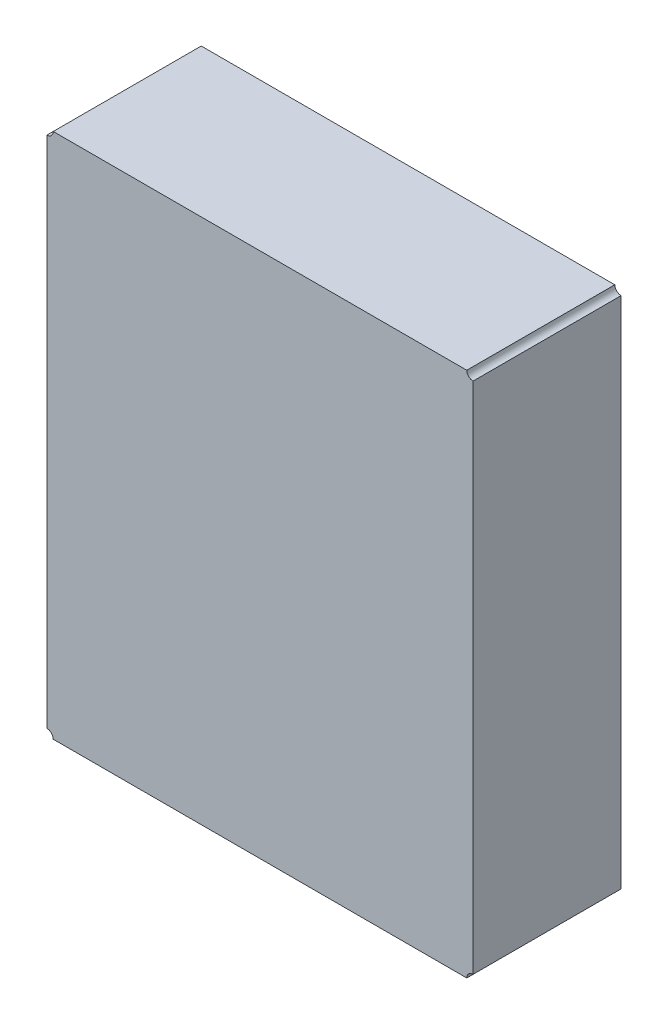
ISO-10303-21;
HEADER;
FILE_DESCRIPTION(('STEP AP214'),'2;1');
FILE_NAME('part.step','',(''),(''),'','','');
FILE_SCHEMA(('AUTOMOTIVE_DESIGN { 1 0 10303 214 1 1 1 1 }'));
ENDSEC;
DATA;
#1=APPLICATION_CONTEXT('core data for automotive mechanical design processes');
#2=APPLICATION_PROTOCOL_DEFINITION('international standard','automotive_design',2000,#1);
#3=PRODUCT_CONTEXT('',#1,'mechanical');
#4=PRODUCT('Part','Part','',(#3));
#5=PRODUCT_RELATED_PRODUCT_CATEGORY('part','',(#4));
#6=PRODUCT_DEFINITION_FORMATION('','',#4);
#7=PRODUCT_DEFINITION_CONTEXT('part definition',#1,'design');
#8=PRODUCT_DEFINITION('design','',#6,#7);
#9=PRODUCT_DEFINITION_SHAPE('','',#8);
#10=(LENGTH_UNIT() NAMED_UNIT(*) SI_UNIT(.MILLI.,.METRE.));
#11=(NAMED_UNIT(*) PLANE_ANGLE_UNIT() SI_UNIT($,.RADIAN.));
#12=(NAMED_UNIT(*) SI_UNIT($,.STERADIAN.) SOLID_ANGLE_UNIT());
#13=UNCERTAINTY_MEASURE_WITH_UNIT(LENGTH_MEASURE(1.E-05),#10,'distance_accuracy_value','');
#14=(GEOMETRIC_REPRESENTATION_CONTEXT(3) GLOBAL_UNCERTAINTY_ASSIGNED_CONTEXT((#13)) GLOBAL_UNIT_ASSIGNED_CONTEXT((#10,
#11,#12)) REPRESENTATION_CONTEXT('',''));
#15=CARTESIAN_POINT('',(0.,0.,0.));
#16=DIRECTION('',(0.,0.,1.));
#17=DIRECTION('',(1.,0.,0.));
#18=AXIS2_PLACEMENT_3D('',#15,#16,#17);
#19=CARTESIAN_POINT('',(95.25,81.28,1.5));
#20=DIRECTION('',(0.,0.,-1.));
#21=DIRECTION('',(-1.,0.,0.));
#22=AXIS2_PLACEMENT_3D('',#19,#20,#21);
#23=CYLINDRICAL_SURFACE('',#22,0.063500000000008);
#24=CARTESIAN_POINT('',(95.25,81.28,0.));
#25=DIRECTION('',(0.,0.,1.));
#26=DIRECTION('',(1.,0.,0.));
#27=AXIS2_PLACEMENT_3D('',#24,#25,#26);
#28=CIRCLE('',#27,0.063500000000008);
#29=CARTESIAN_POINT('',(95.1865,81.28,0.));
#30=VERTEX_POINT('',#29);
#31=CARTESIAN_POINT('',(95.25,81.2165,0.));
#32=VERTEX_POINT('',#31);
#33=EDGE_CURVE('E143',#30,#32,#28,.T.);
#34=ORIENTED_EDGE('',*,*,#33,.F.);
#35=DIRECTION('',(0.,0.,-1.));
#36=VECTOR('',#35,1.);
#37=CARTESIAN_POINT('',(95.1865,81.28,1.5));
#38=LINE('',#37,#36);
#39=CARTESIAN_POINT('',(95.1865,81.28,1.5));
#40=VERTEX_POINT('',#39);
#41=EDGE_CURVE('E11',#40,#30,#38,.T.);
#42=ORIENTED_EDGE('',*,*,#41,.F.);
#43=CARTESIAN_POINT('',(95.25,81.28,1.5));
#44=DIRECTION('',(0.,0.,1.));
#45=DIRECTION('',(1.,0.,0.));
#46=AXIS2_PLACEMENT_3D('',#43,#44,#45);
#47=CIRCLE('',#46,0.063500000000008);
#48=CARTESIAN_POINT('',(95.25,81.2165,1.5));
#49=VERTEX_POINT('',#48);
#50=EDGE_CURVE('E170',#40,#49,#47,.T.);
#51=ORIENTED_EDGE('',*,*,#50,.T.);
#52=DIRECTION('',(0.,0.,-1.));
#53=VECTOR('',#52,1.);
#54=CARTESIAN_POINT('',(95.25,81.2165,1.5));
#55=LINE('',#54,#53);
#56=EDGE_CURVE('E94',#49,#32,#55,.T.);
#57=ORIENTED_EDGE('',*,*,#56,.T.);
#58=EDGE_LOOP('',(#34,#42,#51,#57));
#59=FACE_BOUND('',#58,.T.);
#60=ADVANCED_FACE('F43',(#59),#23,.F.);
#61=CARTESIAN_POINT('',(0.,81.28,1.5));
#62=DIRECTION('',(0.,1.,0.));
#63=DIRECTION('',(0.,0.,1.));
#64=AXIS2_PLACEMENT_3D('',#61,#62,#63);
#65=PLANE('',#64);
#66=DIRECTION('',(1.,0.,0.));
#67=VECTOR('',#66,1.);
#68=CARTESIAN_POINT('',(0.,81.28,0.));
#69=LINE('',#68,#67);
#70=CARTESIAN_POINT('',(90.9955,81.28,0.));
#71=VERTEX_POINT('',#70);
#72=EDGE_CURVE('E147',#71,#30,#69,.T.);
#73=ORIENTED_EDGE('',*,*,#72,.F.);
#74=DIRECTION('',(0.,0.,-1.));
#75=VECTOR('',#74,1.);
#76=CARTESIAN_POINT('',(90.9955,81.28,1.5));
#77=LINE('',#76,#75);
#78=CARTESIAN_POINT('',(90.9955,81.28,1.5));
#79=VERTEX_POINT('',#78);
#80=EDGE_CURVE('E52',#79,#71,#77,.T.);
#81=ORIENTED_EDGE('',*,*,#80,.F.);
#82=DIRECTION('',(1.,0.,0.));
#83=VECTOR('',#82,1.);
#84=CARTESIAN_POINT('',(0.,81.28,1.5));
#85=LINE('',#84,#83);
#86=EDGE_CURVE('E203',#79,#40,#85,.T.);
#87=ORIENTED_EDGE('',*,*,#86,.T.);
#88=ORIENTED_EDGE('',*,*,#41,.T.);
#89=EDGE_LOOP('',(#73,#81,#87,#88));
#90=FACE_BOUND('',#89,.T.);
#91=ADVANCED_FACE('F194',(#90),#65,.T.);
#92=CARTESIAN_POINT('',(90.932,81.28,1.5));
#93=DIRECTION('',(0.,0.,-1.));
#94=DIRECTION('',(-1.,0.,0.));
#95=AXIS2_PLACEMENT_3D('',#92,#93,#94);
#96=CYLINDRICAL_SURFACE('',#95,0.0634999999999802);
#97=CARTESIAN_POINT('',(90.932,81.28,0.));
#98=DIRECTION('',(0.,0.,1.));
#99=DIRECTION('',(1.,0.,0.));
#100=AXIS2_PLACEMENT_3D('',#97,#98,#99);
#101=CIRCLE('',#100,0.0634999999999802);
#102=CARTESIAN_POINT('',(90.932,81.2165,0.));
#103=VERTEX_POINT('',#102);
#104=EDGE_CURVE('E151',#103,#71,#101,.T.);
#105=ORIENTED_EDGE('',*,*,#104,.F.);
#106=DIRECTION('',(0.,0.,-1.));
#107=VECTOR('',#106,1.);
#108=CARTESIAN_POINT('',(90.932,81.2165,1.5));
#109=LINE('',#108,#107);
#110=CARTESIAN_POINT('',(90.932,81.2165,1.5));
#111=VERTEX_POINT('',#110);
#112=EDGE_CURVE('E180',#111,#103,#109,.T.);
#113=ORIENTED_EDGE('',*,*,#112,.F.);
#114=CARTESIAN_POINT('',(90.932,81.28,1.5));
#115=DIRECTION('',(0.,0.,1.));
#116=DIRECTION('',(1.,0.,0.));
#117=AXIS2_PLACEMENT_3D('',#114,#115,#116);
#118=CIRCLE('',#117,0.0634999999999802);
#119=EDGE_CURVE('E190',#111,#79,#118,.T.);
#120=ORIENTED_EDGE('',*,*,#119,.T.);
#121=ORIENTED_EDGE('',*,*,#80,.T.);
#122=EDGE_LOOP('',(#105,#113,#120,#121));
#123=FACE_BOUND('',#122,.T.);
#124=ADVANCED_FACE('F188',(#123),#96,.F.);
#125=CARTESIAN_POINT('',(90.932,0.,1.5));
#126=DIRECTION('',(-1.,0.,0.));
#127=DIRECTION('',(0.,0.,1.));
#128=AXIS2_PLACEMENT_3D('',#125,#126,#127);
#129=PLANE('',#128);
#130=DIRECTION('',(0.,1.,0.));
#131=VECTOR('',#130,1.);
#132=CARTESIAN_POINT('',(90.932,0.,0.));
#133=LINE('',#132,#131);
#134=CARTESIAN_POINT('',(90.932,76.0095,0.));
#135=VERTEX_POINT('',#134);
#136=EDGE_CURVE('E155',#135,#103,#133,.T.);
#137=ORIENTED_EDGE('',*,*,#136,.F.);
#138=DIRECTION('',(0.,0.,-1.));
#139=VECTOR('',#138,1.);
#140=CARTESIAN_POINT('',(90.932,76.0095,1.5));
#141=LINE('',#140,#139);
#142=CARTESIAN_POINT('',(90.932,76.0095,1.5));
#143=VERTEX_POINT('',#142);
#144=EDGE_CURVE('E177',#143,#135,#141,.T.);
#145=ORIENTED_EDGE('',*,*,#144,.F.);
#146=DIRECTION('',(0.,1.,0.));
#147=VECTOR('',#146,1.);
#148=CARTESIAN_POINT('',(90.932,0.,1.5));
#149=LINE('',#148,#147);
#150=EDGE_CURVE('E202',#143,#111,#149,.T.);
#151=ORIENTED_EDGE('',*,*,#150,.T.);
#152=ORIENTED_EDGE('',*,*,#112,.T.);
#153=EDGE_LOOP('',(#137,#145,#151,#152));
#154=FACE_BOUND('',#153,.T.);
#155=ADVANCED_FACE('F200',(#154),#129,.T.);
#156=CARTESIAN_POINT('',(90.932,75.946,1.5));
#157=DIRECTION('',(0.,0.,-1.));
#158=DIRECTION('',(-1.,0.,0.));
#159=AXIS2_PLACEMENT_3D('',#156,#157,#158);
#160=CYLINDRICAL_SURFACE('',#159,0.0634999999999802);
#161=CARTESIAN_POINT('',(90.932,75.946,0.));
#162=DIRECTION('',(0.,0.,1.));
#163=DIRECTION('',(1.,0.,0.));
#164=AXIS2_PLACEMENT_3D('',#161,#162,#163);
#165=CIRCLE('',#164,0.0634999999999802);
#166=CARTESIAN_POINT('',(90.9955,75.946,0.));
#167=VERTEX_POINT('',#166);
#168=EDGE_CURVE('E159',#167,#135,#165,.T.);
#169=ORIENTED_EDGE('',*,*,#168,.F.);
#170=DIRECTION('',(0.,0.,-1.));
#171=VECTOR('',#170,1.);
#172=CARTESIAN_POINT('',(90.9955,75.946,1.5));
#173=LINE('',#172,#171);
#174=CARTESIAN_POINT('',(90.9955,75.946,1.5));
#175=VERTEX_POINT('',#174);
#176=EDGE_CURVE('E132',#175,#167,#173,.T.);
#177=ORIENTED_EDGE('',*,*,#176,.F.);
#178=CARTESIAN_POINT('',(90.932,75.946,1.5));
#179=DIRECTION('',(0.,0.,1.));
#180=DIRECTION('',(1.,0.,0.));
#181=AXIS2_PLACEMENT_3D('',#178,#179,#180);
#182=CIRCLE('',#181,0.0634999999999802);
#183=EDGE_CURVE('E119',#175,#143,#182,.T.);
#184=ORIENTED_EDGE('',*,*,#183,.T.);
#185=ORIENTED_EDGE('',*,*,#144,.T.);
#186=EDGE_LOOP('',(#169,#177,#184,#185));
#187=FACE_BOUND('',#186,.T.);
#188=ADVANCED_FACE('F215',(#187),#160,.F.);
#189=CARTESIAN_POINT('',(0.,75.946,1.5));
#190=DIRECTION('',(0.,1.,0.));
#191=DIRECTION('',(0.,0.,1.));
#192=AXIS2_PLACEMENT_3D('',#189,#190,#191);
#193=PLANE('',#192);
#194=DIRECTION('',(1.,0.,0.));
#195=VECTOR('',#194,1.);
#196=CARTESIAN_POINT('',(0.,75.946,0.));
#197=LINE('',#196,#195);
#198=CARTESIAN_POINT('',(95.1865,75.946,0.));
#199=VERTEX_POINT('',#198);
#200=EDGE_CURVE('E127',#167,#199,#197,.T.);
#201=ORIENTED_EDGE('',*,*,#200,.T.);
#202=DIRECTION('',(0.,0.,-1.));
#203=VECTOR('',#202,1.);
#204=CARTESIAN_POINT('',(95.1865,75.946,1.5));
#205=LINE('',#204,#203);
#206=CARTESIAN_POINT('',(95.1865,75.946,1.5));
#207=VERTEX_POINT('',#206);
#208=EDGE_CURVE('E124',#207,#199,#205,.T.);
#209=ORIENTED_EDGE('',*,*,#208,.F.);
#210=DIRECTION('',(1.,0.,0.));
#211=VECTOR('',#210,1.);
#212=CARTESIAN_POINT('',(0.,75.946,1.5));
#213=LINE('',#212,#211);
#214=EDGE_CURVE('E112',#175,#207,#213,.T.);
#215=ORIENTED_EDGE('',*,*,#214,.F.);
#216=ORIENTED_EDGE('',*,*,#176,.T.);
#217=EDGE_LOOP('',(#201,#209,#215,#216));
#218=FACE_BOUND('',#217,.T.);
#219=ADVANCED_FACE('F125',(#218),#193,.F.);
#220=CARTESIAN_POINT('',(95.25,75.946,1.5));
#221=DIRECTION('',(0.,0.,-1.));
#222=DIRECTION('',(-1.,0.,0.));
#223=AXIS2_PLACEMENT_3D('',#220,#221,#222);
#224=CYLINDRICAL_SURFACE('',#223,0.063500000000008);
#225=CARTESIAN_POINT('',(95.25,75.946,0.));
#226=DIRECTION('',(0.,0.,1.));
#227=DIRECTION('',(1.,0.,0.));
#228=AXIS2_PLACEMENT_3D('',#225,#226,#227);
#229=CIRCLE('',#228,0.063500000000008);
#230=CARTESIAN_POINT('',(95.25,76.0095,0.));
#231=VERTEX_POINT('',#230);
#232=EDGE_CURVE('E165',#231,#199,#229,.T.);
#233=ORIENTED_EDGE('',*,*,#232,.F.);
#234=DIRECTION('',(0.,0.,-1.));
#235=VECTOR('',#234,1.);
#236=CARTESIAN_POINT('',(95.25,76.0095,1.5));
#237=LINE('',#236,#235);
#238=CARTESIAN_POINT('',(95.25,76.0095,1.5));
#239=VERTEX_POINT('',#238);
#240=EDGE_CURVE('E87',#239,#231,#237,.T.);
#241=ORIENTED_EDGE('',*,*,#240,.F.);
#242=CARTESIAN_POINT('',(95.25,75.946,1.5));
#243=DIRECTION('',(0.,0.,1.));
#244=DIRECTION('',(1.,0.,0.));
#245=AXIS2_PLACEMENT_3D('',#242,#243,#244);
#246=CIRCLE('',#245,0.063500000000008);
#247=EDGE_CURVE('E116',#239,#207,#246,.T.);
#248=ORIENTED_EDGE('',*,*,#247,.T.);
#249=ORIENTED_EDGE('',*,*,#208,.T.);
#250=EDGE_LOOP('',(#233,#241,#248,#249));
#251=FACE_BOUND('',#250,.T.);
#252=ADVANCED_FACE('F134',(#251),#224,.F.);
#253=CARTESIAN_POINT('',(95.25,0.,1.5));
#254=DIRECTION('',(-1.,0.,0.));
#255=DIRECTION('',(0.,0.,1.));
#256=AXIS2_PLACEMENT_3D('',#253,#254,#255);
#257=PLANE('',#256);
#258=DIRECTION('',(0.,1.,0.));
#259=VECTOR('',#258,1.);
#260=CARTESIAN_POINT('',(95.25,0.,0.));
#261=LINE('',#260,#259);
#262=EDGE_CURVE('E167',#231,#32,#261,.T.);
#263=ORIENTED_EDGE('',*,*,#262,.T.);
#264=ORIENTED_EDGE('',*,*,#56,.F.);
#265=DIRECTION('',(0.,1.,0.));
#266=VECTOR('',#265,1.);
#267=CARTESIAN_POINT('',(95.25,0.,1.5));
#268=LINE('',#267,#266);
#269=EDGE_CURVE('E60',#239,#49,#268,.T.);
#270=ORIENTED_EDGE('',*,*,#269,.F.);
#271=ORIENTED_EDGE('',*,*,#240,.T.);
#272=EDGE_LOOP('',(#263,#264,#270,#271));
#273=FACE_BOUND('',#272,.T.);
#274=ADVANCED_FACE('F216',(#273),#257,.F.);
#275=CARTESIAN_POINT('',(0.,0.,1.5));
#276=DIRECTION('',(0.,0.,1.));
#277=DIRECTION('',(1.,0.,0.));
#278=AXIS2_PLACEMENT_3D('',#275,#276,#277);
#279=PLANE('',#278);
#280=ORIENTED_EDGE('',*,*,#50,.F.);
#281=ORIENTED_EDGE('',*,*,#86,.F.);
#282=ORIENTED_EDGE('',*,*,#119,.F.);
#283=ORIENTED_EDGE('',*,*,#150,.F.);
#284=ORIENTED_EDGE('',*,*,#183,.F.);
#285=ORIENTED_EDGE('',*,*,#214,.T.);
#286=ORIENTED_EDGE('',*,*,#247,.F.);
#287=ORIENTED_EDGE('',*,*,#269,.T.);
#288=EDGE_LOOP('',(#280,#281,#282,#283,#284,#285,#286,#287));
#289=FACE_BOUND('',#288,.T.);
#290=ADVANCED_FACE('F114',(#289),#279,.T.);
#291=CARTESIAN_POINT('',(0.,0.,0.));
#292=DIRECTION('',(0.,0.,1.));
#293=DIRECTION('',(1.,0.,0.));
#294=AXIS2_PLACEMENT_3D('',#291,#292,#293);
#295=PLANE('',#294);
#296=ORIENTED_EDGE('',*,*,#33,.T.);
#297=ORIENTED_EDGE('',*,*,#262,.F.);
#298=ORIENTED_EDGE('',*,*,#232,.T.);
#299=ORIENTED_EDGE('',*,*,#200,.F.);
#300=ORIENTED_EDGE('',*,*,#168,.T.);
#301=ORIENTED_EDGE('',*,*,#136,.T.);
#302=ORIENTED_EDGE('',*,*,#104,.T.);
#303=ORIENTED_EDGE('',*,*,#72,.T.);
#304=EDGE_LOOP('',(#296,#297,#298,#299,#300,#301,#302,#303));
#305=FACE_BOUND('',#304,.T.);
#306=ADVANCED_FACE('F196',(#305),#295,.F.);
#307=CLOSED_SHELL('',(#60,#91,#124,#155,#188,#219,#252,#274,#290,#306));
#308=MANIFOLD_SOLID_BREP('B2',#307);
#309=ADVANCED_BREP_SHAPE_REPRESENTATION('',(#18,#308),#14);
#310=SHAPE_DEFINITION_REPRESENTATION(#9,#309);
ENDSEC;
END-ISO-10303-21;
